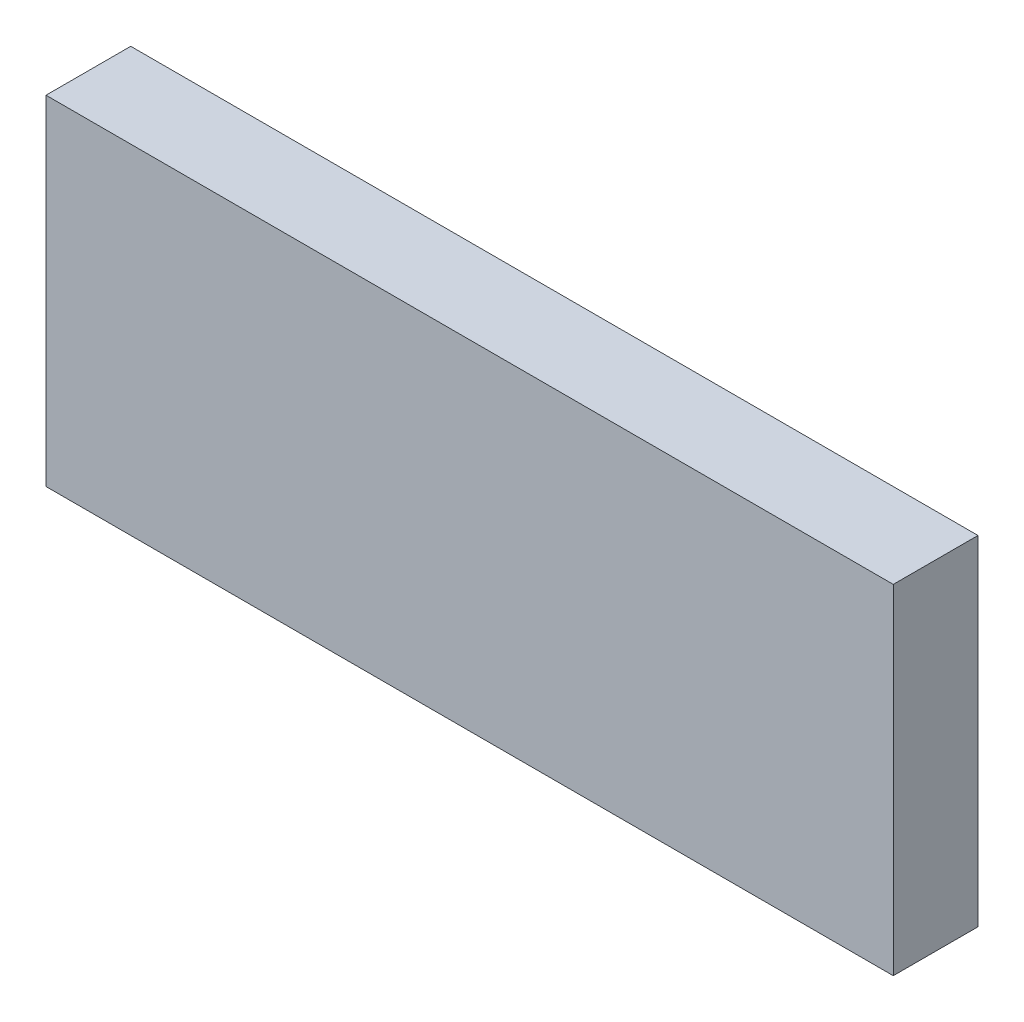
ISO-10303-21;
HEADER;
FILE_DESCRIPTION(('STEP AP214'),'2;1');
FILE_NAME('part.step','',(''),(''),'','','');
FILE_SCHEMA(('AUTOMOTIVE_DESIGN { 1 0 10303 214 1 1 1 1 }'));
ENDSEC;
DATA;
#1=APPLICATION_CONTEXT('core data for automotive mechanical design processes');
#2=APPLICATION_PROTOCOL_DEFINITION('international standard','automotive_design',2000,#1);
#3=PRODUCT_CONTEXT('',#1,'mechanical');
#4=PRODUCT('Part','Part','',(#3));
#5=PRODUCT_RELATED_PRODUCT_CATEGORY('part','',(#4));
#6=PRODUCT_DEFINITION_FORMATION('','',#4);
#7=PRODUCT_DEFINITION_CONTEXT('part definition',#1,'design');
#8=PRODUCT_DEFINITION('design','',#6,#7);
#9=PRODUCT_DEFINITION_SHAPE('','',#8);
#10=(LENGTH_UNIT() NAMED_UNIT(*) SI_UNIT(.MILLI.,.METRE.));
#11=(NAMED_UNIT(*) PLANE_ANGLE_UNIT() SI_UNIT($,.RADIAN.));
#12=(NAMED_UNIT(*) SI_UNIT($,.STERADIAN.) SOLID_ANGLE_UNIT());
#13=UNCERTAINTY_MEASURE_WITH_UNIT(LENGTH_MEASURE(1.E-05),#10,'distance_accuracy_value','');
#14=(GEOMETRIC_REPRESENTATION_CONTEXT(3) GLOBAL_UNCERTAINTY_ASSIGNED_CONTEXT((#13)) GLOBAL_UNIT_ASSIGNED_CONTEXT((#10,
#11,#12)) REPRESENTATION_CONTEXT('',''));
#15=CARTESIAN_POINT('',(0.,0.,0.));
#16=DIRECTION('',(0.,0.,1.));
#17=DIRECTION('',(1.,0.,0.));
#18=AXIS2_PLACEMENT_3D('',#15,#16,#17);
#19=CARTESIAN_POINT('',(0.,0.,5.));
#20=DIRECTION('',(1.,0.,0.));
#21=DIRECTION('',(0.,0.,-1.));
#22=AXIS2_PLACEMENT_3D('',#19,#20,#21);
#23=PLANE('',#22);
#24=DIRECTION('',(0.,-1.,0.));
#25=VECTOR('',#24,1.);
#26=CARTESIAN_POINT('',(0.,0.,0.));
#27=LINE('',#26,#25);
#28=CARTESIAN_POINT('',(0.,0.,0.));
#29=VERTEX_POINT('',#28);
#30=CARTESIAN_POINT('',(0.,-20.,0.));
#31=VERTEX_POINT('',#30);
#32=EDGE_CURVE('E107',#29,#31,#27,.T.);
#33=ORIENTED_EDGE('',*,*,#32,.T.);
#34=DIRECTION('',(0.,0.,-1.));
#35=VECTOR('',#34,1.);
#36=CARTESIAN_POINT('',(0.,-20.,5.));
#37=LINE('',#36,#35);
#38=CARTESIAN_POINT('',(0.,-20.,5.));
#39=VERTEX_POINT('',#38);
#40=EDGE_CURVE('E11',#39,#31,#37,.T.);
#41=ORIENTED_EDGE('',*,*,#40,.F.);
#42=DIRECTION('',(0.,-1.,0.));
#43=VECTOR('',#42,1.);
#44=CARTESIAN_POINT('',(0.,0.,5.));
#45=LINE('',#44,#43);
#46=CARTESIAN_POINT('',(0.,0.,5.));
#47=VERTEX_POINT('',#46);
#48=EDGE_CURVE('E91',#47,#39,#45,.T.);
#49=ORIENTED_EDGE('',*,*,#48,.F.);
#50=DIRECTION('',(0.,0.,-1.));
#51=VECTOR('',#50,1.);
#52=CARTESIAN_POINT('',(0.,0.,5.));
#53=LINE('',#52,#51);
#54=EDGE_CURVE('E103',#47,#29,#53,.T.);
#55=ORIENTED_EDGE('',*,*,#54,.T.);
#56=EDGE_LOOP('',(#33,#41,#49,#55));
#57=FACE_BOUND('',#56,.T.);
#58=ADVANCED_FACE('F39',(#57),#23,.F.);
#59=CARTESIAN_POINT('',(0.,-20.,5.));
#60=DIRECTION('',(0.,1.,0.));
#61=DIRECTION('',(0.,0.,1.));
#62=AXIS2_PLACEMENT_3D('',#59,#60,#61);
#63=PLANE('',#62);
#64=DIRECTION('',(1.,0.,0.));
#65=VECTOR('',#64,1.);
#66=CARTESIAN_POINT('',(0.,-20.,0.));
#67=LINE('',#66,#65);
#68=CARTESIAN_POINT('',(50.,-20.,0.));
#69=VERTEX_POINT('',#68);
#70=EDGE_CURVE('E96',#31,#69,#67,.T.);
#71=ORIENTED_EDGE('',*,*,#70,.T.);
#72=DIRECTION('',(0.,0.,-1.));
#73=VECTOR('',#72,1.);
#74=CARTESIAN_POINT('',(50.,-20.,5.));
#75=LINE('',#74,#73);
#76=CARTESIAN_POINT('',(50.,-20.,5.));
#77=VERTEX_POINT('',#76);
#78=EDGE_CURVE('E48',#77,#69,#75,.T.);
#79=ORIENTED_EDGE('',*,*,#78,.F.);
#80=DIRECTION('',(1.,0.,0.));
#81=VECTOR('',#80,1.);
#82=CARTESIAN_POINT('',(0.,-20.,5.));
#83=LINE('',#82,#81);
#84=EDGE_CURVE('E86',#39,#77,#83,.T.);
#85=ORIENTED_EDGE('',*,*,#84,.F.);
#86=ORIENTED_EDGE('',*,*,#40,.T.);
#87=EDGE_LOOP('',(#71,#79,#85,#86));
#88=FACE_BOUND('',#87,.T.);
#89=ADVANCED_FACE('F95',(#88),#63,.F.);
#90=CARTESIAN_POINT('',(50.,0.,5.));
#91=DIRECTION('',(-1.,0.,0.));
#92=DIRECTION('',(0.,0.,1.));
#93=AXIS2_PLACEMENT_3D('',#90,#91,#92);
#94=PLANE('',#93);
#95=DIRECTION('',(0.,1.,0.));
#96=VECTOR('',#95,1.);
#97=CARTESIAN_POINT('',(50.,0.,0.));
#98=LINE('',#97,#96);
#99=CARTESIAN_POINT('',(50.,0.,0.));
#100=VERTEX_POINT('',#99);
#101=EDGE_CURVE('E73',#69,#100,#98,.T.);
#102=ORIENTED_EDGE('',*,*,#101,.T.);
#103=DIRECTION('',(0.,0.,-1.));
#104=VECTOR('',#103,1.);
#105=CARTESIAN_POINT('',(50.,0.,5.));
#106=LINE('',#105,#104);
#107=CARTESIAN_POINT('',(50.,0.,5.));
#108=VERTEX_POINT('',#107);
#109=EDGE_CURVE('E98',#108,#100,#106,.T.);
#110=ORIENTED_EDGE('',*,*,#109,.F.);
#111=DIRECTION('',(0.,1.,0.));
#112=VECTOR('',#111,1.);
#113=CARTESIAN_POINT('',(50.,0.,5.));
#114=LINE('',#113,#112);
#115=EDGE_CURVE('E89',#77,#108,#114,.T.);
#116=ORIENTED_EDGE('',*,*,#115,.F.);
#117=ORIENTED_EDGE('',*,*,#78,.T.);
#118=EDGE_LOOP('',(#102,#110,#116,#117));
#119=FACE_BOUND('',#118,.T.);
#120=ADVANCED_FACE('F99',(#119),#94,.F.);
#121=CARTESIAN_POINT('',(0.,0.,5.));
#122=DIRECTION('',(0.,-1.,0.));
#123=DIRECTION('',(0.,0.,-1.));
#124=AXIS2_PLACEMENT_3D('',#121,#122,#123);
#125=PLANE('',#124);
#126=DIRECTION('',(-1.,0.,0.));
#127=VECTOR('',#126,1.);
#128=CARTESIAN_POINT('',(0.,0.,0.));
#129=LINE('',#128,#127);
#130=EDGE_CURVE('E79',#100,#29,#129,.T.);
#131=ORIENTED_EDGE('',*,*,#130,.T.);
#132=ORIENTED_EDGE('',*,*,#54,.F.);
#133=DIRECTION('',(-1.,0.,0.));
#134=VECTOR('',#133,1.);
#135=CARTESIAN_POINT('',(0.,0.,5.));
#136=LINE('',#135,#134);
#137=EDGE_CURVE('E56',#108,#47,#136,.T.);
#138=ORIENTED_EDGE('',*,*,#137,.F.);
#139=ORIENTED_EDGE('',*,*,#109,.T.);
#140=EDGE_LOOP('',(#131,#132,#138,#139));
#141=FACE_BOUND('',#140,.T.);
#142=ADVANCED_FACE('F120',(#141),#125,.F.);
#143=CARTESIAN_POINT('',(0.,0.,5.));
#144=DIRECTION('',(0.,0.,1.));
#145=DIRECTION('',(1.,0.,0.));
#146=AXIS2_PLACEMENT_3D('',#143,#144,#145);
#147=PLANE('',#146);
#148=ORIENTED_EDGE('',*,*,#48,.T.);
#149=ORIENTED_EDGE('',*,*,#84,.T.);
#150=ORIENTED_EDGE('',*,*,#115,.T.);
#151=ORIENTED_EDGE('',*,*,#137,.T.);
#152=EDGE_LOOP('',(#148,#149,#150,#151));
#153=FACE_BOUND('',#152,.T.);
#154=ADVANCED_FACE('F87',(#153),#147,.T.);
#155=CARTESIAN_POINT('',(0.,0.,0.));
#156=DIRECTION('',(0.,0.,1.));
#157=DIRECTION('',(1.,0.,0.));
#158=AXIS2_PLACEMENT_3D('',#155,#156,#157);
#159=PLANE('',#158);
#160=ORIENTED_EDGE('',*,*,#32,.F.);
#161=ORIENTED_EDGE('',*,*,#130,.F.);
#162=ORIENTED_EDGE('',*,*,#101,.F.);
#163=ORIENTED_EDGE('',*,*,#70,.F.);
#164=EDGE_LOOP('',(#160,#161,#162,#163));
#165=FACE_BOUND('',#164,.T.);
#166=ADVANCED_FACE('F123',(#165),#159,.F.);
#167=CLOSED_SHELL('',(#58,#89,#120,#142,#154,#166));
#168=MANIFOLD_SOLID_BREP('B2',#167);
#169=ADVANCED_BREP_SHAPE_REPRESENTATION('',(#18,#168),#14);
#170=SHAPE_DEFINITION_REPRESENTATION(#9,#169);
ENDSEC;
END-ISO-10303-21;
